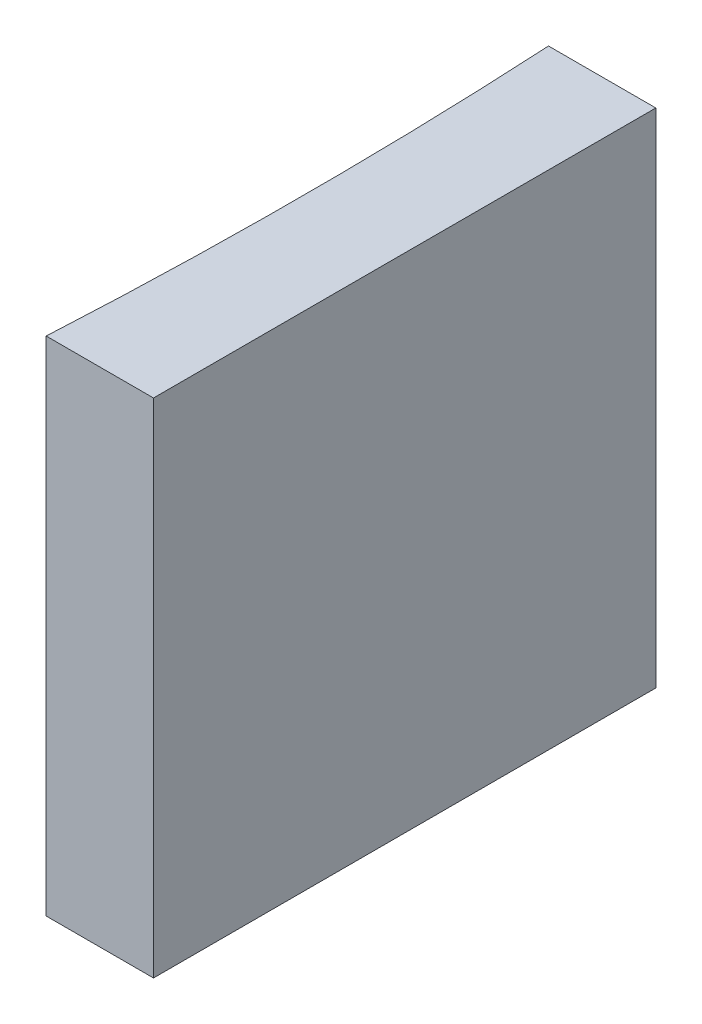
ISO-10303-21;
HEADER;
FILE_DESCRIPTION(('STEP AP214'),'2;1');
FILE_NAME('part.step','',(''),(''),'','','');
FILE_SCHEMA(('AUTOMOTIVE_DESIGN { 1 0 10303 214 1 1 1 1 }'));
ENDSEC;
DATA;
#1=APPLICATION_CONTEXT('core data for automotive mechanical design processes');
#2=APPLICATION_PROTOCOL_DEFINITION('international standard','automotive_design',2000,#1);
#3=PRODUCT_CONTEXT('',#1,'mechanical');
#4=PRODUCT('Part','Part','',(#3));
#5=PRODUCT_RELATED_PRODUCT_CATEGORY('part','',(#4));
#6=PRODUCT_DEFINITION_FORMATION('','',#4);
#7=PRODUCT_DEFINITION_CONTEXT('part definition',#1,'design');
#8=PRODUCT_DEFINITION('design','',#6,#7);
#9=PRODUCT_DEFINITION_SHAPE('','',#8);
#10=(LENGTH_UNIT() NAMED_UNIT(*) SI_UNIT(.MILLI.,.METRE.));
#11=(NAMED_UNIT(*) PLANE_ANGLE_UNIT() SI_UNIT($,.RADIAN.));
#12=(NAMED_UNIT(*) SI_UNIT($,.STERADIAN.) SOLID_ANGLE_UNIT());
#13=UNCERTAINTY_MEASURE_WITH_UNIT(LENGTH_MEASURE(1.E-05),#10,'distance_accuracy_value','');
#14=(GEOMETRIC_REPRESENTATION_CONTEXT(3) GLOBAL_UNCERTAINTY_ASSIGNED_CONTEXT((#13)) GLOBAL_UNIT_ASSIGNED_CONTEXT((#10,
#11,#12)) REPRESENTATION_CONTEXT('',''));
#15=CARTESIAN_POINT('',(0.,0.,0.));
#16=DIRECTION('',(0.,0.,1.));
#17=DIRECTION('',(1.,0.,0.));
#18=AXIS2_PLACEMENT_3D('',#15,#16,#17);
#19=CARTESIAN_POINT('',(0.,10.,0.));
#20=DIRECTION('',(0.,0.,1.));
#21=DIRECTION('',(1.,0.,0.));
#22=AXIS2_PLACEMENT_3D('',#19,#20,#21);
#23=PLANE('',#22);
#24=DIRECTION('',(-1.,0.,0.));
#25=VECTOR('',#24,1.);
#26=CARTESIAN_POINT('',(0.,0.,0.));
#27=LINE('',#26,#25);
#28=CARTESIAN_POINT('',(0.,0.,0.));
#29=VERTEX_POINT('',#28);
#30=CARTESIAN_POINT('',(-2.13641553543242,0.,0.));
#31=VERTEX_POINT('',#30);
#32=EDGE_CURVE('E98',#29,#31,#27,.T.);
#33=ORIENTED_EDGE('',*,*,#32,.T.);
#34=DIRECTION('',(0.,-1.,0.));
#35=VECTOR('',#34,1.);
#36=CARTESIAN_POINT('',(-2.13641553543242,10.,0.));
#37=LINE('',#36,#35);
#38=CARTESIAN_POINT('',(-2.13641553543242,10.,0.));
#39=VERTEX_POINT('',#38);
#40=EDGE_CURVE('E11',#39,#31,#37,.T.);
#41=ORIENTED_EDGE('',*,*,#40,.F.);
#42=DIRECTION('',(-1.,0.,0.));
#43=VECTOR('',#42,1.);
#44=CARTESIAN_POINT('',(0.,10.,0.));
#45=LINE('',#44,#43);
#46=CARTESIAN_POINT('',(0.,10.,0.));
#47=VERTEX_POINT('',#46);
#48=EDGE_CURVE('E86',#47,#39,#45,.T.);
#49=ORIENTED_EDGE('',*,*,#48,.F.);
#50=DIRECTION('',(0.,-1.,0.));
#51=VECTOR('',#50,1.);
#52=CARTESIAN_POINT('',(0.,10.,0.));
#53=LINE('',#52,#51);
#54=EDGE_CURVE('E94',#47,#29,#53,.T.);
#55=ORIENTED_EDGE('',*,*,#54,.T.);
#56=EDGE_LOOP('',(#33,#41,#49,#55));
#57=FACE_BOUND('',#56,.T.);
#58=ADVANCED_FACE('F35',(#57),#23,.F.);
#59=CARTESIAN_POINT('',(-93.7,10.,5.00000000000001));
#60=DIRECTION('',(0.,-1.,0.));
#61=DIRECTION('',(0.,0.,-1.));
#62=AXIS2_PLACEMENT_3D('',#59,#60,#61);
#63=CYLINDRICAL_SURFACE('',#62,91.7);
#64=CARTESIAN_POINT('',(-93.7,0.,5.00000000000001));
#65=DIRECTION('',(0.,-1.,0.));
#66=DIRECTION('',(0.,0.,1.));
#67=AXIS2_PLACEMENT_3D('',#64,#65,#66);
#68=CIRCLE('',#67,91.7);
#69=CARTESIAN_POINT('',(-2.13641553543242,0.,10.));
#70=VERTEX_POINT('',#69);
#71=EDGE_CURVE('E90',#31,#70,#68,.T.);
#72=ORIENTED_EDGE('',*,*,#71,.T.);
#73=DIRECTION('',(0.,-1.,0.));
#74=VECTOR('',#73,1.);
#75=CARTESIAN_POINT('',(-2.13641553543242,10.,10.));
#76=LINE('',#75,#74);
#77=CARTESIAN_POINT('',(-2.13641553543242,10.,10.));
#78=VERTEX_POINT('',#77);
#79=EDGE_CURVE('E43',#78,#70,#76,.T.);
#80=ORIENTED_EDGE('',*,*,#79,.F.);
#81=CARTESIAN_POINT('',(-93.7,10.,5.00000000000001));
#82=DIRECTION('',(0.,-1.,0.));
#83=DIRECTION('',(0.,0.,1.));
#84=AXIS2_PLACEMENT_3D('',#81,#82,#83);
#85=CIRCLE('',#84,91.7);
#86=EDGE_CURVE('E81',#39,#78,#85,.T.);
#87=ORIENTED_EDGE('',*,*,#86,.F.);
#88=ORIENTED_EDGE('',*,*,#40,.T.);
#89=EDGE_LOOP('',(#72,#80,#87,#88));
#90=FACE_BOUND('',#89,.T.);
#91=ADVANCED_FACE('F89',(#90),#63,.F.);
#92=CARTESIAN_POINT('',(0.,10.,10.));
#93=DIRECTION('',(0.,0.,-1.));
#94=DIRECTION('',(-1.,0.,0.));
#95=AXIS2_PLACEMENT_3D('',#92,#93,#94);
#96=PLANE('',#95);
#97=DIRECTION('',(1.,0.,0.));
#98=VECTOR('',#97,1.);
#99=CARTESIAN_POINT('',(0.,0.,10.));
#100=LINE('',#99,#98);
#101=CARTESIAN_POINT('',(0.,0.,10.));
#102=VERTEX_POINT('',#101);
#103=EDGE_CURVE('E68',#70,#102,#100,.T.);
#104=ORIENTED_EDGE('',*,*,#103,.T.);
#105=DIRECTION('',(0.,-1.,0.));
#106=VECTOR('',#105,1.);
#107=CARTESIAN_POINT('',(0.,10.,10.));
#108=LINE('',#107,#106);
#109=CARTESIAN_POINT('',(0.,10.,10.));
#110=VERTEX_POINT('',#109);
#111=EDGE_CURVE('E91',#110,#102,#108,.T.);
#112=ORIENTED_EDGE('',*,*,#111,.F.);
#113=DIRECTION('',(1.,0.,0.));
#114=VECTOR('',#113,1.);
#115=CARTESIAN_POINT('',(0.,10.,10.));
#116=LINE('',#115,#114);
#117=EDGE_CURVE('E84',#78,#110,#116,.T.);
#118=ORIENTED_EDGE('',*,*,#117,.F.);
#119=ORIENTED_EDGE('',*,*,#79,.T.);
#120=EDGE_LOOP('',(#104,#112,#118,#119));
#121=FACE_BOUND('',#120,.T.);
#122=ADVANCED_FACE('F92',(#121),#96,.F.);
#123=CARTESIAN_POINT('',(0.,10.,0.));
#124=DIRECTION('',(-1.,0.,0.));
#125=DIRECTION('',(0.,0.,1.));
#126=AXIS2_PLACEMENT_3D('',#123,#124,#125);
#127=PLANE('',#126);
#128=DIRECTION('',(0.,0.,-1.));
#129=VECTOR('',#128,1.);
#130=CARTESIAN_POINT('',(0.,0.,0.));
#131=LINE('',#130,#129);
#132=EDGE_CURVE('E74',#102,#29,#131,.T.);
#133=ORIENTED_EDGE('',*,*,#132,.T.);
#134=ORIENTED_EDGE('',*,*,#54,.F.);
#135=DIRECTION('',(0.,0.,-1.));
#136=VECTOR('',#135,1.);
#137=CARTESIAN_POINT('',(0.,10.,0.));
#138=LINE('',#137,#136);
#139=EDGE_CURVE('E51',#110,#47,#138,.T.);
#140=ORIENTED_EDGE('',*,*,#139,.F.);
#141=ORIENTED_EDGE('',*,*,#111,.T.);
#142=EDGE_LOOP('',(#133,#134,#140,#141));
#143=FACE_BOUND('',#142,.T.);
#144=ADVANCED_FACE('F105',(#143),#127,.F.);
#145=CARTESIAN_POINT('',(-93.7,10.,5.00000000000001));
#146=DIRECTION('',(0.,1.,0.));
#147=DIRECTION('',(0.,0.,1.));
#148=AXIS2_PLACEMENT_3D('',#145,#146,#147);
#149=PLANE('',#148);
#150=ORIENTED_EDGE('',*,*,#48,.T.);
#151=ORIENTED_EDGE('',*,*,#86,.T.);
#152=ORIENTED_EDGE('',*,*,#117,.T.);
#153=ORIENTED_EDGE('',*,*,#139,.T.);
#154=EDGE_LOOP('',(#150,#151,#152,#153));
#155=FACE_BOUND('',#154,.T.);
#156=ADVANCED_FACE('F82',(#155),#149,.T.);
#157=CARTESIAN_POINT('',(-93.7,0.,5.00000000000001));
#158=DIRECTION('',(0.,1.,0.));
#159=DIRECTION('',(0.,0.,1.));
#160=AXIS2_PLACEMENT_3D('',#157,#158,#159);
#161=PLANE('',#160);
#162=ORIENTED_EDGE('',*,*,#32,.F.);
#163=ORIENTED_EDGE('',*,*,#132,.F.);
#164=ORIENTED_EDGE('',*,*,#103,.F.);
#165=ORIENTED_EDGE('',*,*,#71,.F.);
#166=EDGE_LOOP('',(#162,#163,#164,#165));
#167=FACE_BOUND('',#166,.T.);
#168=ADVANCED_FACE('F108',(#167),#161,.F.);
#169=CLOSED_SHELL('',(#58,#91,#122,#144,#156,#168));
#170=MANIFOLD_SOLID_BREP('B2',#169);
#171=ADVANCED_BREP_SHAPE_REPRESENTATION('',(#18,#170),#14);
#172=SHAPE_DEFINITION_REPRESENTATION(#9,#171);
ENDSEC;
END-ISO-10303-21;
